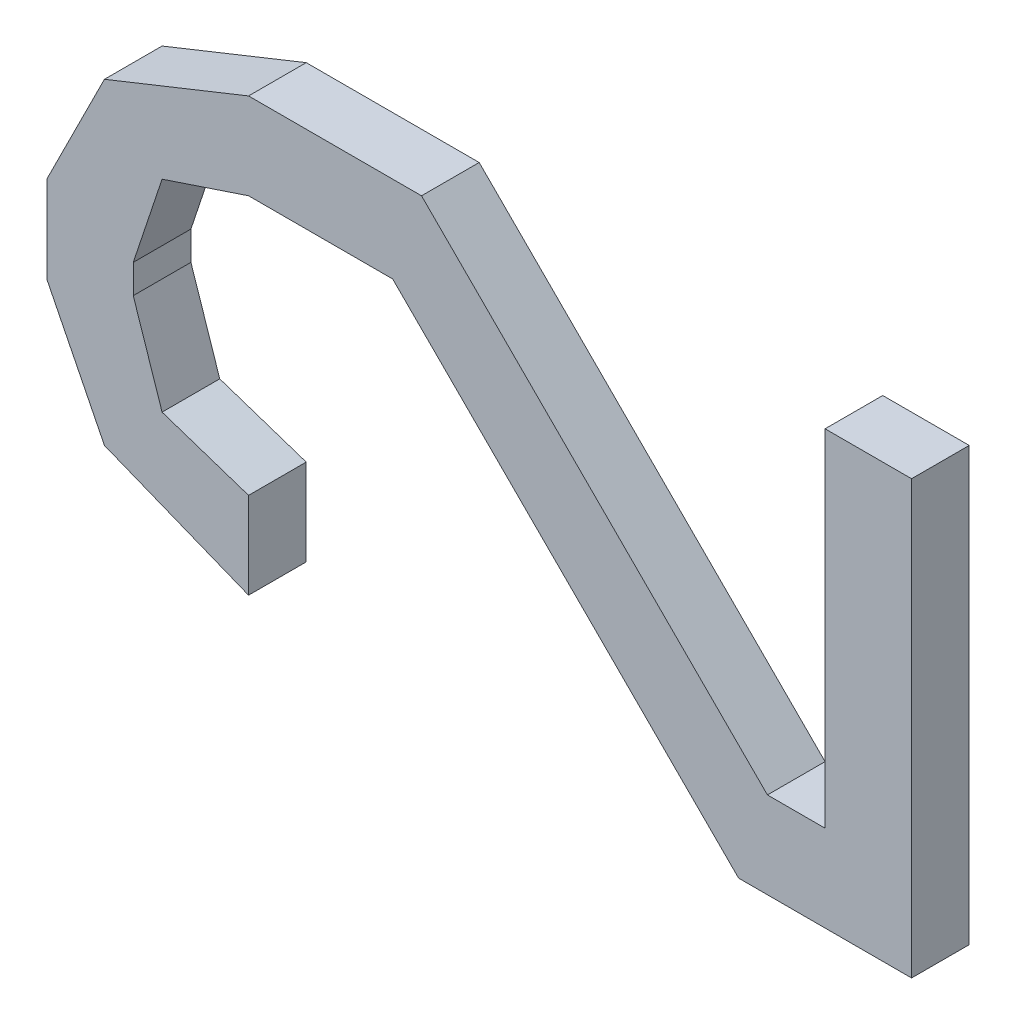
ISO-10303-21;
HEADER;
FILE_DESCRIPTION(('STEP AP214'),'2;1');
FILE_NAME('part.step','',(''),(''),'','','');
FILE_SCHEMA(('AUTOMOTIVE_DESIGN { 1 0 10303 214 1 1 1 1 }'));
ENDSEC;
DATA;
#1=APPLICATION_CONTEXT('core data for automotive mechanical design processes');
#2=APPLICATION_PROTOCOL_DEFINITION('international standard','automotive_design',2000,#1);
#3=PRODUCT_CONTEXT('',#1,'mechanical');
#4=PRODUCT('Part','Part','',(#3));
#5=PRODUCT_RELATED_PRODUCT_CATEGORY('part','',(#4));
#6=PRODUCT_DEFINITION_FORMATION('','',#4);
#7=PRODUCT_DEFINITION_CONTEXT('part definition',#1,'design');
#8=PRODUCT_DEFINITION('design','',#6,#7);
#9=PRODUCT_DEFINITION_SHAPE('','',#8);
#10=(LENGTH_UNIT() NAMED_UNIT(*) SI_UNIT(.MILLI.,.METRE.));
#11=(NAMED_UNIT(*) PLANE_ANGLE_UNIT() SI_UNIT($,.RADIAN.));
#12=(NAMED_UNIT(*) SI_UNIT($,.STERADIAN.) SOLID_ANGLE_UNIT());
#13=UNCERTAINTY_MEASURE_WITH_UNIT(LENGTH_MEASURE(1.E-05),#10,'distance_accuracy_value','');
#14=(GEOMETRIC_REPRESENTATION_CONTEXT(3) GLOBAL_UNCERTAINTY_ASSIGNED_CONTEXT((#13)) GLOBAL_UNIT_ASSIGNED_CONTEXT((#10,
#11,#12)) REPRESENTATION_CONTEXT('',''));
#15=CARTESIAN_POINT('',(0.,0.,0.));
#16=DIRECTION('',(0.,0.,1.));
#17=DIRECTION('',(1.,0.,0.));
#18=AXIS2_PLACEMENT_3D('',#15,#16,#17);
#19=CARTESIAN_POINT('',(-0.1905,0.01904999999999,0.0254));
#20=DIRECTION('',(0.,0.,-1.));
#21=DIRECTION('',(-1.,0.,0.));
#22=AXIS2_PLACEMENT_3D('',#19,#20,#21);
#23=PLANE('',#22);
#24=DIRECTION('',(-0.447213595499958,0.894427190999916,0.));
#25=VECTOR('',#24,1.);
#26=CARTESIAN_POINT('',(-0.1905,-0.01904999999999,0.0254));
#27=LINE('',#26,#25);
#28=CARTESIAN_POINT('',(-0.1905,-0.01904999999999,0.0254));
#29=VERTEX_POINT('',#28);
#30=CARTESIAN_POINT('',(-0.165099999999999,-0.0698499999999995,0.0254));
#31=VERTEX_POINT('',#30);
#32=EDGE_CURVE('E236',#29,#31,#27,.F.);
#33=ORIENTED_EDGE('',*,*,#32,.T.);
#34=DIRECTION('',(-0.928476690885259,0.371390676354104,0.));
#35=VECTOR('',#34,1.);
#36=CARTESIAN_POINT('',(-0.1651,-0.06985,0.0254));
#37=LINE('',#36,#35);
#38=CARTESIAN_POINT('',(-0.101600000000001,-0.0952499999999921,0.0254));
#39=VERTEX_POINT('',#38);
#40=EDGE_CURVE('E232',#31,#39,#37,.F.);
#41=ORIENTED_EDGE('',*,*,#40,.T.);
#42=DIRECTION('',(0.,1.,0.));
#43=VECTOR('',#42,1.);
#44=CARTESIAN_POINT('',(-0.1016,-0.09524999999999,0.0254));
#45=LINE('',#44,#43);
#46=CARTESIAN_POINT('',(-0.1016,-0.05715000000001,0.0254));
#47=VERTEX_POINT('',#46);
#48=EDGE_CURVE('E228',#39,#47,#45,.T.);
#49=ORIENTED_EDGE('',*,*,#48,.T.);
#50=DIRECTION('',(0.948683298050514,-0.316227766016838,0.));
#51=VECTOR('',#50,1.);
#52=CARTESIAN_POINT('',(-0.1016,-0.05715000000001,0.0254));
#53=LINE('',#52,#51);
#54=CARTESIAN_POINT('',(-0.1397,-0.04445000000001,0.0254));
#55=VERTEX_POINT('',#54);
#56=EDGE_CURVE('E224',#47,#55,#53,.F.);
#57=ORIENTED_EDGE('',*,*,#56,.T.);
#58=DIRECTION('',(0.316227766016838,-0.948683298050514,0.));
#59=VECTOR('',#58,1.);
#60=CARTESIAN_POINT('',(-0.1397,-0.04445000000001,0.0254));
#61=LINE('',#60,#59);
#62=CARTESIAN_POINT('',(-0.152400000000001,-0.00634999999999831,0.0254));
#63=VERTEX_POINT('',#62);
#64=EDGE_CURVE('E220',#55,#63,#61,.F.);
#65=ORIENTED_EDGE('',*,*,#64,.T.);
#66=DIRECTION('',(0.,1.,0.));
#67=VECTOR('',#66,1.);
#68=CARTESIAN_POINT('',(-0.1524,-0.006349999999998,0.0254));
#69=LINE('',#68,#67);
#70=CARTESIAN_POINT('',(-0.1524,0.006349999999998,0.0254));
#71=VERTEX_POINT('',#70);
#72=EDGE_CURVE('E216',#63,#71,#69,.T.);
#73=ORIENTED_EDGE('',*,*,#72,.T.);
#74=DIRECTION('',(-0.316227766016838,-0.948683298050514,0.));
#75=VECTOR('',#74,1.);
#76=CARTESIAN_POINT('',(-0.1524,0.006349999999998,0.0254));
#77=LINE('',#76,#75);
#78=CARTESIAN_POINT('',(-0.139699999999999,0.0444500000000097,0.0254));
#79=VERTEX_POINT('',#78);
#80=EDGE_CURVE('E212',#71,#79,#77,.F.);
#81=ORIENTED_EDGE('',*,*,#80,.T.);
#82=DIRECTION('',(-0.948683298050514,-0.316227766016838,0.));
#83=VECTOR('',#82,1.);
#84=CARTESIAN_POINT('',(-0.1397,0.04445000000001,0.0254));
#85=LINE('',#84,#83);
#86=CARTESIAN_POINT('',(-0.1016,0.05715000000001,0.0254));
#87=VERTEX_POINT('',#86);
#88=EDGE_CURVE('E208',#79,#87,#85,.F.);
#89=ORIENTED_EDGE('',*,*,#88,.T.);
#90=DIRECTION('',(1.,0.,0.));
#91=VECTOR('',#90,1.);
#92=CARTESIAN_POINT('',(-0.1016,0.05715000000001,0.0254));
#93=LINE('',#92,#91);
#94=CARTESIAN_POINT('',(-0.0381,0.05715000000001,0.0254));
#95=VERTEX_POINT('',#94);
#96=EDGE_CURVE('E204',#87,#95,#93,.T.);
#97=ORIENTED_EDGE('',*,*,#96,.T.);
#98=DIRECTION('',(-0.707106781186548,0.707106781186548,0.));
#99=VECTOR('',#98,1.);
#100=CARTESIAN_POINT('',(-0.0381,0.05715000000001,0.0254));
#101=LINE('',#100,#99);
#102=CARTESIAN_POINT('',(0.1143,-0.09524999999999,0.0254));
#103=VERTEX_POINT('',#102);
#104=EDGE_CURVE('E200',#95,#103,#101,.F.);
#105=ORIENTED_EDGE('',*,*,#104,.T.);
#106=DIRECTION('',(1.,0.,0.));
#107=VECTOR('',#106,1.);
#108=CARTESIAN_POINT('',(0.1143,-0.09524999999999,0.0254));
#109=LINE('',#108,#107);
#110=CARTESIAN_POINT('',(0.1905,-0.09524999999999,0.0254));
#111=VERTEX_POINT('',#110);
#112=EDGE_CURVE('E196',#103,#111,#109,.T.);
#113=ORIENTED_EDGE('',*,*,#112,.T.);
#114=DIRECTION('',(0.,1.,0.));
#115=VECTOR('',#114,1.);
#116=CARTESIAN_POINT('',(0.1905,-0.09524999999999,0.0254));
#117=LINE('',#116,#115);
#118=CARTESIAN_POINT('',(0.1905,0.09524999999999,0.0254));
#119=VERTEX_POINT('',#118);
#120=EDGE_CURVE('E192',#111,#119,#117,.T.);
#121=ORIENTED_EDGE('',*,*,#120,.T.);
#122=DIRECTION('',(1.,0.,0.));
#123=VECTOR('',#122,1.);
#124=CARTESIAN_POINT('',(0.1905,0.09524999999999,0.0254));
#125=LINE('',#124,#123);
#126=CARTESIAN_POINT('',(0.1524,0.09524999999999,0.0254));
#127=VERTEX_POINT('',#126);
#128=EDGE_CURVE('E188',#119,#127,#125,.F.);
#129=ORIENTED_EDGE('',*,*,#128,.T.);
#130=DIRECTION('',(0.,1.,0.));
#131=VECTOR('',#130,1.);
#132=CARTESIAN_POINT('',(0.1524,0.09524999999999,0.0254));
#133=LINE('',#132,#131);
#134=CARTESIAN_POINT('',(0.1524,-0.05715000000001,0.0254));
#135=VERTEX_POINT('',#134);
#136=EDGE_CURVE('E184',#127,#135,#133,.F.);
#137=ORIENTED_EDGE('',*,*,#136,.T.);
#138=DIRECTION('',(1.,0.,0.));
#139=VECTOR('',#138,1.);
#140=CARTESIAN_POINT('',(0.1524,-0.05715000000001,0.0254));
#141=LINE('',#140,#139);
#142=CARTESIAN_POINT('',(0.127,-0.05715000000001,0.0254));
#143=VERTEX_POINT('',#142);
#144=EDGE_CURVE('E180',#135,#143,#141,.F.);
#145=ORIENTED_EDGE('',*,*,#144,.T.);
#146=DIRECTION('',(0.707106781186548,-0.707106781186548,0.));
#147=VECTOR('',#146,1.);
#148=CARTESIAN_POINT('',(0.127,-0.05715000000001,0.0254));
#149=LINE('',#148,#147);
#150=CARTESIAN_POINT('',(-0.0254,0.09524999999999,0.0254));
#151=VERTEX_POINT('',#150);
#152=EDGE_CURVE('E176',#143,#151,#149,.F.);
#153=ORIENTED_EDGE('',*,*,#152,.T.);
#154=DIRECTION('',(1.,0.,0.));
#155=VECTOR('',#154,1.);
#156=CARTESIAN_POINT('',(-0.0254,0.09524999999999,0.0254));
#157=LINE('',#156,#155);
#158=CARTESIAN_POINT('',(-0.1016,0.09524999999999,0.0254));
#159=VERTEX_POINT('',#158);
#160=EDGE_CURVE('E152',#151,#159,#157,.F.);
#161=ORIENTED_EDGE('',*,*,#160,.T.);
#162=DIRECTION('',(0.928476690885259,0.371390676354104,0.));
#163=VECTOR('',#162,1.);
#164=CARTESIAN_POINT('',(-0.1016,0.09524999999999,0.0254));
#165=LINE('',#164,#163);
#166=CARTESIAN_POINT('',(-0.165099999999999,0.0698499999999978,0.0254));
#167=VERTEX_POINT('',#166);
#168=EDGE_CURVE('E154',#159,#167,#165,.F.);
#169=ORIENTED_EDGE('',*,*,#168,.T.);
#170=DIRECTION('',(0.447213595499958,0.894427190999916,0.));
#171=VECTOR('',#170,1.);
#172=CARTESIAN_POINT('',(-0.1651,0.06985,0.0254));
#173=LINE('',#172,#171);
#174=CARTESIAN_POINT('',(-0.190500000000002,0.019049999999991,0.0254));
#175=VERTEX_POINT('',#174);
#176=EDGE_CURVE('E20',#167,#175,#173,.F.);
#177=ORIENTED_EDGE('',*,*,#176,.T.);
#178=DIRECTION('',(0.,1.,0.));
#179=VECTOR('',#178,1.);
#180=CARTESIAN_POINT('',(-0.1905,0.01904999999999,0.0254));
#181=LINE('',#180,#179);
#182=EDGE_CURVE('E241',#175,#29,#181,.F.);
#183=ORIENTED_EDGE('',*,*,#182,.T.);
#184=EDGE_LOOP('',(#33,#41,#49,#57,#65,#73,#81,#89,#97,#105,#113,#121,#129,#137,#145,#153,#161,
#169,#177,#183));
#185=FACE_BOUND('',#184,.T.);
#186=ADVANCED_FACE('F17',(#185),#23,.F.);
#187=CARTESIAN_POINT('',(-0.1651,0.06985,0.));
#188=DIRECTION('',(0.894427190999916,-0.447213595499958,0.));
#189=DIRECTION('',(0.447213595499958,0.894427190999916,0.));
#190=AXIS2_PLACEMENT_3D('',#187,#188,#189);
#191=PLANE('',#190);
#192=DIRECTION('',(0.,0.,-1.));
#193=VECTOR('',#192,1.);
#194=CARTESIAN_POINT('',(-0.1905,0.01904999999999,0.));
#195=LINE('',#194,#193);
#196=CARTESIAN_POINT('',(-0.190500000000002,0.019049999999991,0.));
#197=VERTEX_POINT('',#196);
#198=EDGE_CURVE('E165',#197,#175,#195,.F.);
#199=ORIENTED_EDGE('',*,*,#198,.T.);
#200=ORIENTED_EDGE('',*,*,#176,.F.);
#201=DIRECTION('',(0.,0.,1.));
#202=VECTOR('',#201,1.);
#203=CARTESIAN_POINT('',(-0.165099999999997,0.0698499999999914,0.));
#204=LINE('',#203,#202);
#205=CARTESIAN_POINT('',(-0.165099999999999,0.0698499999999978,0.));
#206=VERTEX_POINT('',#205);
#207=EDGE_CURVE('E160',#167,#206,#204,.F.);
#208=ORIENTED_EDGE('',*,*,#207,.T.);
#209=DIRECTION('',(0.447213595499888,0.894427190999951,0.));
#210=VECTOR('',#209,1.);
#211=CARTESIAN_POINT('',(-0.1905,0.01904999999999,0.));
#212=LINE('',#211,#210);
#213=EDGE_CURVE('E244',#197,#206,#212,.T.);
#214=ORIENTED_EDGE('',*,*,#213,.F.);
#215=EDGE_LOOP('',(#199,#200,#208,#214));
#216=FACE_BOUND('',#215,.T.);
#217=ADVANCED_FACE('F162',(#216),#191,.F.);
#218=CARTESIAN_POINT('',(-0.1016,0.09524999999999,0.));
#219=DIRECTION('',(0.371390676354104,-0.928476690885259,0.));
#220=DIRECTION('',(0.928476690885259,0.371390676354104,0.));
#221=AXIS2_PLACEMENT_3D('',#218,#219,#220);
#222=PLANE('',#221);
#223=ORIENTED_EDGE('',*,*,#207,.F.);
#224=ORIENTED_EDGE('',*,*,#168,.F.);
#225=DIRECTION('',(0.,0.,-1.));
#226=VECTOR('',#225,1.);
#227=CARTESIAN_POINT('',(-0.1016,0.09524999999999,0.));
#228=LINE('',#227,#226);
#229=CARTESIAN_POINT('',(-0.1016,0.09524999999999,0.));
#230=VERTEX_POINT('',#229);
#231=EDGE_CURVE('E172',#159,#230,#228,.T.);
#232=ORIENTED_EDGE('',*,*,#231,.T.);
#233=DIRECTION('',(0.92847669088531,0.371390676353978,0.));
#234=VECTOR('',#233,1.);
#235=CARTESIAN_POINT('',(-0.1651,0.06985,0.));
#236=LINE('',#235,#234);
#237=EDGE_CURVE('E169',#206,#230,#236,.T.);
#238=ORIENTED_EDGE('',*,*,#237,.F.);
#239=EDGE_LOOP('',(#223,#224,#232,#238));
#240=FACE_BOUND('',#239,.T.);
#241=ADVANCED_FACE('F167',(#240),#222,.F.);
#242=CARTESIAN_POINT('',(-0.0254,0.09524999999999,0.));
#243=DIRECTION('',(0.,-1.,0.));
#244=DIRECTION('',(0.,0.,-1.));
#245=AXIS2_PLACEMENT_3D('',#242,#243,#244);
#246=PLANE('',#245);
#247=ORIENTED_EDGE('',*,*,#231,.F.);
#248=ORIENTED_EDGE('',*,*,#160,.F.);
#249=DIRECTION('',(0.,0.,1.));
#250=VECTOR('',#249,1.);
#251=CARTESIAN_POINT('',(-0.0254,0.09524999999999,0.));
#252=LINE('',#251,#250);
#253=CARTESIAN_POINT('',(-0.0254,0.09524999999999,0.));
#254=VERTEX_POINT('',#253);
#255=EDGE_CURVE('E178',#151,#254,#252,.F.);
#256=ORIENTED_EDGE('',*,*,#255,.T.);
#257=DIRECTION('',(-1.,0.,0.));
#258=VECTOR('',#257,1.);
#259=CARTESIAN_POINT('',(-0.1905,0.09524999999999,0.));
#260=LINE('',#259,#258);
#261=EDGE_CURVE('E247',#230,#254,#260,.F.);
#262=ORIENTED_EDGE('',*,*,#261,.F.);
#263=EDGE_LOOP('',(#247,#248,#256,#262));
#264=FACE_BOUND('',#263,.T.);
#265=ADVANCED_FACE('F376',(#264),#246,.F.);
#266=CARTESIAN_POINT('',(0.127,-0.05715000000001,0.));
#267=DIRECTION('',(-0.707106781186548,-0.707106781186548,0.));
#268=DIRECTION('',(0.707106781186548,-0.707106781186548,0.));
#269=AXIS2_PLACEMENT_3D('',#266,#267,#268);
#270=PLANE('',#269);
#271=ORIENTED_EDGE('',*,*,#255,.F.);
#272=ORIENTED_EDGE('',*,*,#152,.F.);
#273=DIRECTION('',(0.,0.,-1.));
#274=VECTOR('',#273,1.);
#275=CARTESIAN_POINT('',(0.127,-0.05715000000001,0.));
#276=LINE('',#275,#274);
#277=CARTESIAN_POINT('',(0.127,-0.05715000000001,0.));
#278=VERTEX_POINT('',#277);
#279=EDGE_CURVE('E182',#143,#278,#276,.T.);
#280=ORIENTED_EDGE('',*,*,#279,.T.);
#281=DIRECTION('',(0.707106781186547,-0.707106781186548,0.));
#282=VECTOR('',#281,1.);
#283=CARTESIAN_POINT('',(-0.0254,0.09524999999999,0.));
#284=LINE('',#283,#282);
#285=EDGE_CURVE('E250',#254,#278,#284,.T.);
#286=ORIENTED_EDGE('',*,*,#285,.F.);
#287=EDGE_LOOP('',(#271,#272,#280,#286));
#288=FACE_BOUND('',#287,.T.);
#289=ADVANCED_FACE('F374',(#288),#270,.F.);
#290=CARTESIAN_POINT('',(0.1524,-0.05715000000001,0.));
#291=DIRECTION('',(0.,-1.,0.));
#292=DIRECTION('',(0.,0.,-1.));
#293=AXIS2_PLACEMENT_3D('',#290,#291,#292);
#294=PLANE('',#293);
#295=ORIENTED_EDGE('',*,*,#279,.F.);
#296=ORIENTED_EDGE('',*,*,#144,.F.);
#297=DIRECTION('',(0.,0.,-1.));
#298=VECTOR('',#297,1.);
#299=CARTESIAN_POINT('',(0.1524,-0.05715000000001,0.));
#300=LINE('',#299,#298);
#301=CARTESIAN_POINT('',(0.1524,-0.05715000000001,0.));
#302=VERTEX_POINT('',#301);
#303=EDGE_CURVE('E186',#135,#302,#300,.T.);
#304=ORIENTED_EDGE('',*,*,#303,.T.);
#305=DIRECTION('',(-1.,0.,0.));
#306=VECTOR('',#305,1.);
#307=CARTESIAN_POINT('',(-0.1905,-0.05715000000001,0.));
#308=LINE('',#307,#306);
#309=EDGE_CURVE('E253',#278,#302,#308,.F.);
#310=ORIENTED_EDGE('',*,*,#309,.F.);
#311=EDGE_LOOP('',(#295,#296,#304,#310));
#312=FACE_BOUND('',#311,.T.);
#313=ADVANCED_FACE('F369',(#312),#294,.F.);
#314=CARTESIAN_POINT('',(0.1524,0.09524999999999,0.));
#315=DIRECTION('',(1.,0.,0.));
#316=DIRECTION('',(0.,0.,-1.));
#317=AXIS2_PLACEMENT_3D('',#314,#315,#316);
#318=PLANE('',#317);
#319=ORIENTED_EDGE('',*,*,#303,.F.);
#320=ORIENTED_EDGE('',*,*,#136,.F.);
#321=DIRECTION('',(0.,0.,-1.));
#322=VECTOR('',#321,1.);
#323=CARTESIAN_POINT('',(0.1524,0.09524999999999,0.));
#324=LINE('',#323,#322);
#325=CARTESIAN_POINT('',(0.1524,0.09524999999999,0.));
#326=VERTEX_POINT('',#325);
#327=EDGE_CURVE('E190',#127,#326,#324,.T.);
#328=ORIENTED_EDGE('',*,*,#327,.T.);
#329=DIRECTION('',(0.,1.,0.));
#330=VECTOR('',#329,1.);
#331=CARTESIAN_POINT('',(0.1524,0.01904999999999,0.));
#332=LINE('',#331,#330);
#333=EDGE_CURVE('E256',#302,#326,#332,.T.);
#334=ORIENTED_EDGE('',*,*,#333,.F.);
#335=EDGE_LOOP('',(#319,#320,#328,#334));
#336=FACE_BOUND('',#335,.T.);
#337=ADVANCED_FACE('F364',(#336),#318,.F.);
#338=CARTESIAN_POINT('',(0.1905,0.09524999999999,0.));
#339=DIRECTION('',(0.,-1.,0.));
#340=DIRECTION('',(0.,0.,-1.));
#341=AXIS2_PLACEMENT_3D('',#338,#339,#340);
#342=PLANE('',#341);
#343=ORIENTED_EDGE('',*,*,#327,.F.);
#344=ORIENTED_EDGE('',*,*,#128,.F.);
#345=DIRECTION('',(0.,0.,1.));
#346=VECTOR('',#345,1.);
#347=CARTESIAN_POINT('',(0.1905,0.09524999999999,0.));
#348=LINE('',#347,#346);
#349=CARTESIAN_POINT('',(0.1905,0.09524999999999,0.));
#350=VERTEX_POINT('',#349);
#351=EDGE_CURVE('E194',#119,#350,#348,.F.);
#352=ORIENTED_EDGE('',*,*,#351,.T.);
#353=DIRECTION('',(-1.,0.,0.));
#354=VECTOR('',#353,1.);
#355=CARTESIAN_POINT('',(-0.1905,0.09524999999999,0.));
#356=LINE('',#355,#354);
#357=EDGE_CURVE('E259',#326,#350,#356,.F.);
#358=ORIENTED_EDGE('',*,*,#357,.F.);
#359=EDGE_LOOP('',(#343,#344,#352,#358));
#360=FACE_BOUND('',#359,.T.);
#361=ADVANCED_FACE('F359',(#360),#342,.F.);
#362=CARTESIAN_POINT('',(0.1905,-0.09524999999999,0.));
#363=DIRECTION('',(-1.,0.,0.));
#364=DIRECTION('',(0.,0.,1.));
#365=AXIS2_PLACEMENT_3D('',#362,#363,#364);
#366=PLANE('',#365);
#367=ORIENTED_EDGE('',*,*,#351,.F.);
#368=ORIENTED_EDGE('',*,*,#120,.F.);
#369=DIRECTION('',(0.,0.,1.));
#370=VECTOR('',#369,1.);
#371=CARTESIAN_POINT('',(0.1905,-0.09524999999999,0.));
#372=LINE('',#371,#370);
#373=CARTESIAN_POINT('',(0.1905,-0.09524999999999,0.));
#374=VERTEX_POINT('',#373);
#375=EDGE_CURVE('E198',#111,#374,#372,.F.);
#376=ORIENTED_EDGE('',*,*,#375,.T.);
#377=DIRECTION('',(0.,1.,0.));
#378=VECTOR('',#377,1.);
#379=CARTESIAN_POINT('',(0.1905,0.01904999999999,0.));
#380=LINE('',#379,#378);
#381=EDGE_CURVE('E262',#350,#374,#380,.F.);
#382=ORIENTED_EDGE('',*,*,#381,.F.);
#383=EDGE_LOOP('',(#367,#368,#376,#382));
#384=FACE_BOUND('',#383,.T.);
#385=ADVANCED_FACE('F354',(#384),#366,.F.);
#386=CARTESIAN_POINT('',(0.1143,-0.09524999999999,0.));
#387=DIRECTION('',(0.,1.,0.));
#388=DIRECTION('',(0.,0.,1.));
#389=AXIS2_PLACEMENT_3D('',#386,#387,#388);
#390=PLANE('',#389);
#391=ORIENTED_EDGE('',*,*,#375,.F.);
#392=ORIENTED_EDGE('',*,*,#112,.F.);
#393=DIRECTION('',(0.,0.,1.));
#394=VECTOR('',#393,1.);
#395=CARTESIAN_POINT('',(0.1143,-0.09524999999999,0.));
#396=LINE('',#395,#394);
#397=CARTESIAN_POINT('',(0.1143,-0.09524999999999,0.));
#398=VERTEX_POINT('',#397);
#399=EDGE_CURVE('E202',#103,#398,#396,.F.);
#400=ORIENTED_EDGE('',*,*,#399,.T.);
#401=DIRECTION('',(-1.,0.,0.));
#402=VECTOR('',#401,1.);
#403=CARTESIAN_POINT('',(-0.1905,-0.09524999999999,0.));
#404=LINE('',#403,#402);
#405=EDGE_CURVE('E265',#374,#398,#404,.T.);
#406=ORIENTED_EDGE('',*,*,#405,.F.);
#407=EDGE_LOOP('',(#391,#392,#400,#406));
#408=FACE_BOUND('',#407,.T.);
#409=ADVANCED_FACE('F349',(#408),#390,.F.);
#410=CARTESIAN_POINT('',(-0.0381,0.05715000000001,0.));
#411=DIRECTION('',(0.707106781186548,0.707106781186548,0.));
#412=DIRECTION('',(-0.707106781186548,0.707106781186548,0.));
#413=AXIS2_PLACEMENT_3D('',#410,#411,#412);
#414=PLANE('',#413);
#415=ORIENTED_EDGE('',*,*,#399,.F.);
#416=ORIENTED_EDGE('',*,*,#104,.F.);
#417=DIRECTION('',(0.,0.,1.));
#418=VECTOR('',#417,1.);
#419=CARTESIAN_POINT('',(-0.0381,0.05715000000001,0.));
#420=LINE('',#419,#418);
#421=CARTESIAN_POINT('',(-0.0381,0.05715000000001,0.));
#422=VERTEX_POINT('',#421);
#423=EDGE_CURVE('E206',#95,#422,#420,.F.);
#424=ORIENTED_EDGE('',*,*,#423,.T.);
#425=DIRECTION('',(-0.707106781186548,0.707106781186548,0.));
#426=VECTOR('',#425,1.);
#427=CARTESIAN_POINT('',(0.1143,-0.09524999999999,0.));
#428=LINE('',#427,#426);
#429=EDGE_CURVE('E268',#398,#422,#428,.T.);
#430=ORIENTED_EDGE('',*,*,#429,.F.);
#431=EDGE_LOOP('',(#415,#416,#424,#430));
#432=FACE_BOUND('',#431,.T.);
#433=ADVANCED_FACE('F344',(#432),#414,.F.);
#434=CARTESIAN_POINT('',(-0.1016,0.05715000000001,0.));
#435=DIRECTION('',(0.,1.,0.));
#436=DIRECTION('',(0.,0.,1.));
#437=AXIS2_PLACEMENT_3D('',#434,#435,#436);
#438=PLANE('',#437);
#439=ORIENTED_EDGE('',*,*,#423,.F.);
#440=ORIENTED_EDGE('',*,*,#96,.F.);
#441=DIRECTION('',(0.,0.,1.));
#442=VECTOR('',#441,1.);
#443=CARTESIAN_POINT('',(-0.1016,0.05715000000001,0.));
#444=LINE('',#443,#442);
#445=CARTESIAN_POINT('',(-0.1016,0.05715000000001,0.));
#446=VERTEX_POINT('',#445);
#447=EDGE_CURVE('E210',#87,#446,#444,.F.);
#448=ORIENTED_EDGE('',*,*,#447,.T.);
#449=DIRECTION('',(-1.,0.,0.));
#450=VECTOR('',#449,1.);
#451=CARTESIAN_POINT('',(-0.1905,0.05715000000001,0.));
#452=LINE('',#451,#450);
#453=EDGE_CURVE('E271',#422,#446,#452,.T.);
#454=ORIENTED_EDGE('',*,*,#453,.F.);
#455=EDGE_LOOP('',(#439,#440,#448,#454));
#456=FACE_BOUND('',#455,.T.);
#457=ADVANCED_FACE('F339',(#456),#438,.F.);
#458=CARTESIAN_POINT('',(-0.1397,0.04445000000001,0.));
#459=DIRECTION('',(-0.316227766016838,0.948683298050514,0.));
#460=DIRECTION('',(-0.948683298050514,-0.316227766016838,0.));
#461=AXIS2_PLACEMENT_3D('',#458,#459,#460);
#462=PLANE('',#461);
#463=ORIENTED_EDGE('',*,*,#447,.F.);
#464=ORIENTED_EDGE('',*,*,#88,.F.);
#465=DIRECTION('',(0.,0.,1.));
#466=VECTOR('',#465,1.);
#467=CARTESIAN_POINT('',(-0.139699999999996,0.0444500000000088,0.));
#468=LINE('',#467,#466);
#469=CARTESIAN_POINT('',(-0.139699999999999,0.0444500000000097,0.));
#470=VERTEX_POINT('',#469);
#471=EDGE_CURVE('E214',#79,#470,#468,.F.);
#472=ORIENTED_EDGE('',*,*,#471,.T.);
#473=DIRECTION('',(-0.948683298050514,-0.316227766016838,0.));
#474=VECTOR('',#473,1.);
#475=CARTESIAN_POINT('',(-0.1016,0.05715000000001,0.));
#476=LINE('',#475,#474);
#477=EDGE_CURVE('E274',#446,#470,#476,.T.);
#478=ORIENTED_EDGE('',*,*,#477,.F.);
#479=EDGE_LOOP('',(#463,#464,#472,#478));
#480=FACE_BOUND('',#479,.T.);
#481=ADVANCED_FACE('F334',(#480),#462,.F.);
#482=CARTESIAN_POINT('',(-0.1524,0.006349999999998,0.));
#483=DIRECTION('',(-0.948683298050514,0.316227766016838,0.));
#484=DIRECTION('',(-0.316227766016838,-0.948683298050514,0.));
#485=AXIS2_PLACEMENT_3D('',#482,#483,#484);
#486=PLANE('',#485);
#487=ORIENTED_EDGE('',*,*,#471,.F.);
#488=ORIENTED_EDGE('',*,*,#80,.F.);
#489=DIRECTION('',(0.,0.,1.));
#490=VECTOR('',#489,1.);
#491=CARTESIAN_POINT('',(-0.1524,0.006349999999998,0.));
#492=LINE('',#491,#490);
#493=CARTESIAN_POINT('',(-0.1524,0.006349999999998,0.));
#494=VERTEX_POINT('',#493);
#495=EDGE_CURVE('E218',#71,#494,#492,.F.);
#496=ORIENTED_EDGE('',*,*,#495,.T.);
#497=DIRECTION('',(-0.316227766016749,-0.948683298050543,0.));
#498=VECTOR('',#497,1.);
#499=CARTESIAN_POINT('',(-0.1397,0.04445000000001,0.));
#500=LINE('',#499,#498);
#501=EDGE_CURVE('E277',#470,#494,#500,.T.);
#502=ORIENTED_EDGE('',*,*,#501,.F.);
#503=EDGE_LOOP('',(#487,#488,#496,#502));
#504=FACE_BOUND('',#503,.T.);
#505=ADVANCED_FACE('F329',(#504),#486,.F.);
#506=CARTESIAN_POINT('',(-0.1524,-0.006349999999998,0.));
#507=DIRECTION('',(-1.,0.,0.));
#508=DIRECTION('',(0.,0.,1.));
#509=AXIS2_PLACEMENT_3D('',#506,#507,#508);
#510=PLANE('',#509);
#511=ORIENTED_EDGE('',*,*,#495,.F.);
#512=ORIENTED_EDGE('',*,*,#72,.F.);
#513=DIRECTION('',(0.,0.,1.));
#514=VECTOR('',#513,1.);
#515=CARTESIAN_POINT('',(-0.152400000000004,-0.00634999999999918,0.));
#516=LINE('',#515,#514);
#517=CARTESIAN_POINT('',(-0.152400000000001,-0.0063499999999983,0.));
#518=VERTEX_POINT('',#517);
#519=EDGE_CURVE('E222',#63,#518,#516,.F.);
#520=ORIENTED_EDGE('',*,*,#519,.T.);
#521=DIRECTION('',(0.,1.,0.));
#522=VECTOR('',#521,1.);
#523=CARTESIAN_POINT('',(-0.1524,0.01904999999999,0.));
#524=LINE('',#523,#522);
#525=EDGE_CURVE('E280',#494,#518,#524,.F.);
#526=ORIENTED_EDGE('',*,*,#525,.F.);
#527=EDGE_LOOP('',(#511,#512,#520,#526));
#528=FACE_BOUND('',#527,.T.);
#529=ADVANCED_FACE('F324',(#528),#510,.F.);
#530=CARTESIAN_POINT('',(-0.1397,-0.04445000000001,0.));
#531=DIRECTION('',(-0.948683298050514,-0.316227766016838,0.));
#532=DIRECTION('',(0.316227766016838,-0.948683298050514,0.));
#533=AXIS2_PLACEMENT_3D('',#530,#531,#532);
#534=PLANE('',#533);
#535=ORIENTED_EDGE('',*,*,#519,.F.);
#536=ORIENTED_EDGE('',*,*,#64,.F.);
#537=DIRECTION('',(0.,0.,1.));
#538=VECTOR('',#537,1.);
#539=CARTESIAN_POINT('',(-0.1397,-0.04445000000001,0.));
#540=LINE('',#539,#538);
#541=CARTESIAN_POINT('',(-0.1397,-0.04445000000001,0.));
#542=VERTEX_POINT('',#541);
#543=EDGE_CURVE('E226',#55,#542,#540,.F.);
#544=ORIENTED_EDGE('',*,*,#543,.T.);
#545=DIRECTION('',(0.316227766016749,-0.948683298050543,0.));
#546=VECTOR('',#545,1.);
#547=CARTESIAN_POINT('',(-0.1524,-0.006349999999998,0.));
#548=LINE('',#547,#546);
#549=EDGE_CURVE('E283',#518,#542,#548,.T.);
#550=ORIENTED_EDGE('',*,*,#549,.F.);
#551=EDGE_LOOP('',(#535,#536,#544,#550));
#552=FACE_BOUND('',#551,.T.);
#553=ADVANCED_FACE('F319',(#552),#534,.F.);
#554=CARTESIAN_POINT('',(-0.1016,-0.05715000000001,0.));
#555=DIRECTION('',(-0.316227766016838,-0.948683298050514,0.));
#556=DIRECTION('',(0.948683298050514,-0.316227766016838,0.));
#557=AXIS2_PLACEMENT_3D('',#554,#555,#556);
#558=PLANE('',#557);
#559=ORIENTED_EDGE('',*,*,#543,.F.);
#560=ORIENTED_EDGE('',*,*,#56,.F.);
#561=DIRECTION('',(0.,0.,1.));
#562=VECTOR('',#561,1.);
#563=CARTESIAN_POINT('',(-0.1016,-0.05715000000001,0.));
#564=LINE('',#563,#562);
#565=CARTESIAN_POINT('',(-0.1016,-0.05715000000001,0.));
#566=VERTEX_POINT('',#565);
#567=EDGE_CURVE('E230',#47,#566,#564,.F.);
#568=ORIENTED_EDGE('',*,*,#567,.T.);
#569=DIRECTION('',(0.948683298050514,-0.316227766016838,0.));
#570=VECTOR('',#569,1.);
#571=CARTESIAN_POINT('',(-0.1397,-0.04445000000001,0.));
#572=LINE('',#571,#570);
#573=EDGE_CURVE('E286',#542,#566,#572,.T.);
#574=ORIENTED_EDGE('',*,*,#573,.F.);
#575=EDGE_LOOP('',(#559,#560,#568,#574));
#576=FACE_BOUND('',#575,.T.);
#577=ADVANCED_FACE('F314',(#576),#558,.F.);
#578=CARTESIAN_POINT('',(-0.1016,-0.09524999999999,0.));
#579=DIRECTION('',(-1.,0.,0.));
#580=DIRECTION('',(0.,0.,1.));
#581=AXIS2_PLACEMENT_3D('',#578,#579,#580);
#582=PLANE('',#581);
#583=ORIENTED_EDGE('',*,*,#567,.F.);
#584=ORIENTED_EDGE('',*,*,#48,.F.);
#585=DIRECTION('',(0.,0.,1.));
#586=VECTOR('',#585,1.);
#587=CARTESIAN_POINT('',(-0.101600000000003,-0.0952499999999986,0.));
#588=LINE('',#587,#586);
#589=CARTESIAN_POINT('',(-0.101600000000001,-0.0952499999999921,0.));
#590=VERTEX_POINT('',#589);
#591=EDGE_CURVE('E234',#39,#590,#588,.F.);
#592=ORIENTED_EDGE('',*,*,#591,.T.);
#593=DIRECTION('',(0.,1.,0.));
#594=VECTOR('',#593,1.);
#595=CARTESIAN_POINT('',(-0.1016,0.01904999999999,0.));
#596=LINE('',#595,#594);
#597=EDGE_CURVE('E289',#566,#590,#596,.F.);
#598=ORIENTED_EDGE('',*,*,#597,.F.);
#599=EDGE_LOOP('',(#583,#584,#592,#598));
#600=FACE_BOUND('',#599,.T.);
#601=ADVANCED_FACE('F309',(#600),#582,.F.);
#602=CARTESIAN_POINT('',(-0.1651,-0.06985,0.));
#603=DIRECTION('',(0.371390676354104,0.928476690885259,0.));
#604=DIRECTION('',(-0.928476690885259,0.371390676354104,0.));
#605=AXIS2_PLACEMENT_3D('',#602,#603,#604);
#606=PLANE('',#605);
#607=ORIENTED_EDGE('',*,*,#591,.F.);
#608=ORIENTED_EDGE('',*,*,#40,.F.);
#609=DIRECTION('',(0.,0.,1.));
#610=VECTOR('',#609,1.);
#611=CARTESIAN_POINT('',(-0.165099999999996,-0.069849999999998,0.));
#612=LINE('',#611,#610);
#613=CARTESIAN_POINT('',(-0.165099999999999,-0.0698499999999995,0.));
#614=VERTEX_POINT('',#613);
#615=EDGE_CURVE('E238',#31,#614,#612,.F.);
#616=ORIENTED_EDGE('',*,*,#615,.T.);
#617=DIRECTION('',(-0.92847669088531,0.371390676353978,0.));
#618=VECTOR('',#617,1.);
#619=CARTESIAN_POINT('',(-0.1016,-0.09524999999999,0.));
#620=LINE('',#619,#618);
#621=EDGE_CURVE('E292',#590,#614,#620,.T.);
#622=ORIENTED_EDGE('',*,*,#621,.F.);
#623=EDGE_LOOP('',(#607,#608,#616,#622));
#624=FACE_BOUND('',#623,.T.);
#625=ADVANCED_FACE('F304',(#624),#606,.F.);
#626=CARTESIAN_POINT('',(-0.1905,-0.01904999999999,0.));
#627=DIRECTION('',(0.894427190999916,0.447213595499958,0.));
#628=DIRECTION('',(-0.447213595499958,0.894427190999916,0.));
#629=AXIS2_PLACEMENT_3D('',#626,#627,#628);
#630=PLANE('',#629);
#631=ORIENTED_EDGE('',*,*,#615,.F.);
#632=ORIENTED_EDGE('',*,*,#32,.F.);
#633=DIRECTION('',(0.,0.,-1.));
#634=VECTOR('',#633,1.);
#635=CARTESIAN_POINT('',(-0.1905,-0.01904999999999,0.));
#636=LINE('',#635,#634);
#637=CARTESIAN_POINT('',(-0.1905,-0.01904999999999,0.));
#638=VERTEX_POINT('',#637);
#639=EDGE_CURVE('E35',#29,#638,#636,.T.);
#640=ORIENTED_EDGE('',*,*,#639,.T.);
#641=DIRECTION('',(-0.447213595499888,0.894427190999951,0.));
#642=VECTOR('',#641,1.);
#643=CARTESIAN_POINT('',(-0.1651,-0.06985,0.));
#644=LINE('',#643,#642);
#645=EDGE_CURVE('E26',#614,#638,#644,.T.);
#646=ORIENTED_EDGE('',*,*,#645,.F.);
#647=EDGE_LOOP('',(#631,#632,#640,#646));
#648=FACE_BOUND('',#647,.T.);
#649=ADVANCED_FACE('F300',(#648),#630,.F.);
#650=CARTESIAN_POINT('',(-0.1905,0.01904999999999,0.));
#651=DIRECTION('',(1.,0.,0.));
#652=DIRECTION('',(0.,0.,-1.));
#653=AXIS2_PLACEMENT_3D('',#650,#651,#652);
#654=PLANE('',#653);
#655=ORIENTED_EDGE('',*,*,#639,.F.);
#656=ORIENTED_EDGE('',*,*,#182,.F.);
#657=ORIENTED_EDGE('',*,*,#198,.F.);
#658=DIRECTION('',(0.,1.,0.));
#659=VECTOR('',#658,1.);
#660=CARTESIAN_POINT('',(-0.1905,0.01904999999999,0.));
#661=LINE('',#660,#659);
#662=EDGE_CURVE('E11',#638,#197,#661,.T.);
#663=ORIENTED_EDGE('',*,*,#662,.F.);
#664=EDGE_LOOP('',(#655,#656,#657,#663));
#665=FACE_BOUND('',#664,.T.);
#666=ADVANCED_FACE('F379',(#665),#654,.F.);
#667=CARTESIAN_POINT('',(-0.1905,0.01904999999999,0.));
#668=DIRECTION('',(0.,0.,-1.));
#669=DIRECTION('',(-1.,0.,0.));
#670=AXIS2_PLACEMENT_3D('',#667,#668,#669);
#671=PLANE('',#670);
#672=ORIENTED_EDGE('',*,*,#645,.T.);
#673=ORIENTED_EDGE('',*,*,#662,.T.);
#674=ORIENTED_EDGE('',*,*,#213,.T.);
#675=ORIENTED_EDGE('',*,*,#237,.T.);
#676=ORIENTED_EDGE('',*,*,#261,.T.);
#677=ORIENTED_EDGE('',*,*,#285,.T.);
#678=ORIENTED_EDGE('',*,*,#309,.T.);
#679=ORIENTED_EDGE('',*,*,#333,.T.);
#680=ORIENTED_EDGE('',*,*,#357,.T.);
#681=ORIENTED_EDGE('',*,*,#381,.T.);
#682=ORIENTED_EDGE('',*,*,#405,.T.);
#683=ORIENTED_EDGE('',*,*,#429,.T.);
#684=ORIENTED_EDGE('',*,*,#453,.T.);
#685=ORIENTED_EDGE('',*,*,#477,.T.);
#686=ORIENTED_EDGE('',*,*,#501,.T.);
#687=ORIENTED_EDGE('',*,*,#525,.T.);
#688=ORIENTED_EDGE('',*,*,#549,.T.);
#689=ORIENTED_EDGE('',*,*,#573,.T.);
#690=ORIENTED_EDGE('',*,*,#597,.T.);
#691=ORIENTED_EDGE('',*,*,#621,.T.);
#692=EDGE_LOOP('',(#672,#673,#674,#675,#676,#677,#678,#679,#680,#681,#682,#683,#684,#685,#686,
#687,#688,#689,#690,#691));
#693=FACE_BOUND('',#692,.T.);
#694=ADVANCED_FACE('F297',(#693),#671,.T.);
#695=CLOSED_SHELL('',(#186,#217,#241,#265,#289,#313,#337,#361,#385,#409,#433,#457,#481,#505,
#529,#553,#577,#601,#625,#649,#666,#694));
#696=MANIFOLD_SOLID_BREP('B1',#695);
#697=ADVANCED_BREP_SHAPE_REPRESENTATION('',(#18,#696),#14);
#698=SHAPE_DEFINITION_REPRESENTATION(#9,#697);
ENDSEC;
END-ISO-10303-21;
